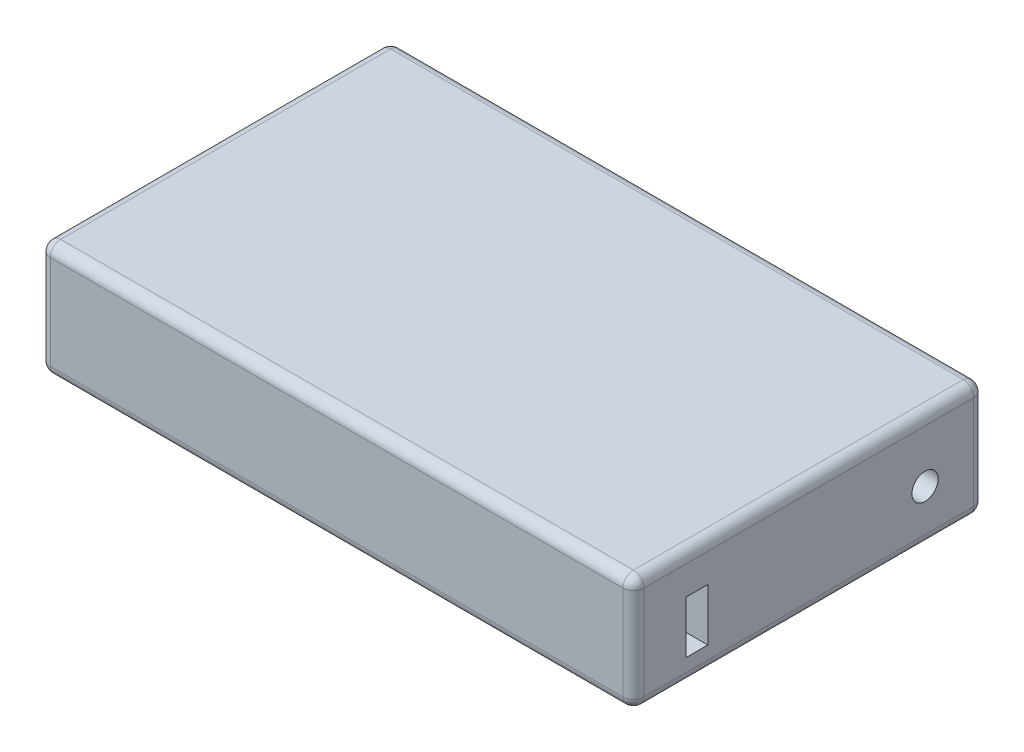
ISO-10303-21;
HEADER;
FILE_DESCRIPTION(('STEP AP214'),'2;1');
FILE_NAME('part.step','',(''),(''),'','','');
FILE_SCHEMA(('AUTOMOTIVE_DESIGN { 1 0 10303 214 1 1 1 1 }'));
ENDSEC;
DATA;
#1=APPLICATION_CONTEXT('core data for automotive mechanical design processes');
#2=APPLICATION_PROTOCOL_DEFINITION('international standard','automotive_design',2000,#1);
#3=PRODUCT_CONTEXT('',#1,'mechanical');
#4=PRODUCT('Part','Part','',(#3));
#5=PRODUCT_RELATED_PRODUCT_CATEGORY('part','',(#4));
#6=PRODUCT_DEFINITION_FORMATION('','',#4);
#7=PRODUCT_DEFINITION_CONTEXT('part definition',#1,'design');
#8=PRODUCT_DEFINITION('design','',#6,#7);
#9=PRODUCT_DEFINITION_SHAPE('','',#8);
#10=(LENGTH_UNIT() NAMED_UNIT(*) SI_UNIT(.MILLI.,.METRE.));
#11=(NAMED_UNIT(*) PLANE_ANGLE_UNIT() SI_UNIT($,.RADIAN.));
#12=(NAMED_UNIT(*) SI_UNIT($,.STERADIAN.) SOLID_ANGLE_UNIT());
#13=UNCERTAINTY_MEASURE_WITH_UNIT(LENGTH_MEASURE(1.E-05),#10,'distance_accuracy_value','');
#14=(GEOMETRIC_REPRESENTATION_CONTEXT(3) GLOBAL_UNCERTAINTY_ASSIGNED_CONTEXT((#13)) GLOBAL_UNIT_ASSIGNED_CONTEXT((#10,
#11,#12)) REPRESENTATION_CONTEXT('',''));
#15=CARTESIAN_POINT('',(0.,0.,0.));
#16=DIRECTION('',(0.,0.,1.));
#17=DIRECTION('',(1.,0.,0.));
#18=AXIS2_PLACEMENT_3D('',#15,#16,#17);
#19=CARTESIAN_POINT('',(72.009,27.94,-42.545));
#20=DIRECTION('',(-1.,0.,0.));
#21=DIRECTION('',(0.,0.,1.));
#22=AXIS2_PLACEMENT_3D('',#19,#20,#21);
#23=PLANE('',#22);
#24=DIRECTION('',(0.,0.,-1.));
#25=VECTOR('',#24,1.);
#26=CARTESIAN_POINT('',(72.009,5.715,29.845));
#27=LINE('',#26,#25);
#28=CARTESIAN_POINT('',(72.009,5.715,29.845));
#29=VERTEX_POINT('',#28);
#30=CARTESIAN_POINT('',(72.009,5.715,24.511));
#31=VERTEX_POINT('',#30);
#32=EDGE_CURVE('E186',#29,#31,#27,.T.);
#33=ORIENTED_EDGE('',*,*,#32,.F.);
#34=DIRECTION('',(0.,-1.,0.));
#35=VECTOR('',#34,1.);
#36=CARTESIAN_POINT('',(72.009,18.415,29.845));
#37=LINE('',#36,#35);
#38=CARTESIAN_POINT('',(72.009,18.415,29.845));
#39=VERTEX_POINT('',#38);
#40=EDGE_CURVE('E60',#39,#29,#37,.T.);
#41=ORIENTED_EDGE('',*,*,#40,.F.);
#42=DIRECTION('',(0.,0.,1.));
#43=VECTOR('',#42,1.);
#44=CARTESIAN_POINT('',(72.009,18.415,29.845));
#45=LINE('',#44,#43);
#46=CARTESIAN_POINT('',(72.009,18.415,24.511));
#47=VERTEX_POINT('',#46);
#48=EDGE_CURVE('E177',#47,#39,#45,.T.);
#49=ORIENTED_EDGE('',*,*,#48,.F.);
#50=DIRECTION('',(0.,1.,0.));
#51=VECTOR('',#50,1.);
#52=CARTESIAN_POINT('',(72.009,18.415,24.511));
#53=LINE('',#52,#51);
#54=EDGE_CURVE('E180',#31,#47,#53,.T.);
#55=ORIENTED_EDGE('',*,*,#54,.F.);
#56=EDGE_LOOP('',(#33,#41,#49,#55));
#57=FACE_BOUND('',#56,.T.);
#58=CARTESIAN_POINT('',(72.009,12.7,-28.194));
#59=DIRECTION('',(1.,0.,0.));
#60=DIRECTION('',(0.,0.,-1.));
#61=AXIS2_PLACEMENT_3D('',#58,#59,#60);
#62=CIRCLE('',#61,3.175);
#63=CARTESIAN_POINT('',(72.009,12.7,-31.369));
#64=VERTEX_POINT('',#63);
#65=EDGE_CURVE('E199',#64,#64,#62,.T.);
#66=ORIENTED_EDGE('',*,*,#65,.F.);
#67=EDGE_LOOP('',(#66));
#68=FACE_BOUND('',#67,.T.);
#69=DIRECTION('',(0.,0.,-1.));
#70=VECTOR('',#69,1.);
#71=CARTESIAN_POINT('',(72.009,2.54,-42.545));
#72=LINE('',#71,#70);
#73=CARTESIAN_POINT('',(72.009,2.54,40.005));
#74=VERTEX_POINT('',#73);
#75=CARTESIAN_POINT('',(72.009,2.54,-40.005));
#76=VERTEX_POINT('',#75);
#77=EDGE_CURVE('E233',#74,#76,#72,.T.);
#78=ORIENTED_EDGE('',*,*,#77,.T.);
#79=DIRECTION('',(0.,-1.,0.));
#80=VECTOR('',#79,1.);
#81=CARTESIAN_POINT('',(72.009,27.94,-40.005));
#82=LINE('',#81,#80);
#83=CARTESIAN_POINT('',(72.009,25.4,-40.005));
#84=VERTEX_POINT('',#83);
#85=EDGE_CURVE('E235',#76,#84,#82,.F.);
#86=ORIENTED_EDGE('',*,*,#85,.T.);
#87=DIRECTION('',(0.,0.,-1.));
#88=VECTOR('',#87,1.);
#89=CARTESIAN_POINT('',(72.009,25.4,42.545));
#90=LINE('',#89,#88);
#91=CARTESIAN_POINT('',(72.009,25.4,40.005));
#92=VERTEX_POINT('',#91);
#93=EDGE_CURVE('E229',#84,#92,#90,.F.);
#94=ORIENTED_EDGE('',*,*,#93,.T.);
#95=DIRECTION('',(0.,-1.,0.));
#96=VECTOR('',#95,1.);
#97=CARTESIAN_POINT('',(72.009,27.94,40.005));
#98=LINE('',#97,#96);
#99=EDGE_CURVE('E231',#92,#74,#98,.T.);
#100=ORIENTED_EDGE('',*,*,#99,.T.);
#101=EDGE_LOOP('',(#78,#86,#94,#100));
#102=FACE_BOUND('',#101,.T.);
#103=ADVANCED_FACE('F43',(#57,#68,#102),#23,.F.);
#104=CARTESIAN_POINT('',(-72.009,27.94,-42.545));
#105=DIRECTION('',(0.,0.,1.));
#106=DIRECTION('',(1.,0.,0.));
#107=AXIS2_PLACEMENT_3D('',#104,#105,#106);
#108=PLANE('',#107);
#109=DIRECTION('',(-1.,0.,0.));
#110=VECTOR('',#109,1.);
#111=CARTESIAN_POINT('',(-72.009,2.54,-42.545));
#112=LINE('',#111,#110);
#113=CARTESIAN_POINT('',(69.469,2.54,-42.545));
#114=VERTEX_POINT('',#113);
#115=CARTESIAN_POINT('',(-69.469,2.54,-42.545));
#116=VERTEX_POINT('',#115);
#117=EDGE_CURVE('E215',#114,#116,#112,.T.);
#118=ORIENTED_EDGE('',*,*,#117,.T.);
#119=DIRECTION('',(0.,-1.,0.));
#120=VECTOR('',#119,1.);
#121=CARTESIAN_POINT('',(-69.469,27.94,-42.545));
#122=LINE('',#121,#120);
#123=CARTESIAN_POINT('',(-69.469,25.4,-42.545));
#124=VERTEX_POINT('',#123);
#125=EDGE_CURVE('E217',#116,#124,#122,.F.);
#126=ORIENTED_EDGE('',*,*,#125,.T.);
#127=DIRECTION('',(-1.,0.,0.));
#128=VECTOR('',#127,1.);
#129=CARTESIAN_POINT('',(72.009,25.4,-42.545));
#130=LINE('',#129,#128);
#131=CARTESIAN_POINT('',(69.469,25.4,-42.545));
#132=VERTEX_POINT('',#131);
#133=EDGE_CURVE('E211',#124,#132,#130,.F.);
#134=ORIENTED_EDGE('',*,*,#133,.T.);
#135=DIRECTION('',(0.,-1.,0.));
#136=VECTOR('',#135,1.);
#137=CARTESIAN_POINT('',(69.469,27.94,-42.545));
#138=LINE('',#137,#136);
#139=EDGE_CURVE('E213',#132,#114,#138,.T.);
#140=ORIENTED_EDGE('',*,*,#139,.T.);
#141=EDGE_LOOP('',(#118,#126,#134,#140));
#142=FACE_BOUND('',#141,.T.);
#143=ADVANCED_FACE('F415',(#142),#108,.F.);
#144=CARTESIAN_POINT('',(-72.009,27.94,-42.545));
#145=DIRECTION('',(1.,0.,0.));
#146=DIRECTION('',(0.,0.,-1.));
#147=AXIS2_PLACEMENT_3D('',#144,#145,#146);
#148=PLANE('',#147);
#149=DIRECTION('',(0.,0.,1.));
#150=VECTOR('',#149,1.);
#151=CARTESIAN_POINT('',(-72.009,25.4,-42.545));
#152=LINE('',#151,#150);
#153=CARTESIAN_POINT('',(-72.009,25.4,40.005));
#154=VERTEX_POINT('',#153);
#155=CARTESIAN_POINT('',(-72.009,25.4,-40.005));
#156=VERTEX_POINT('',#155);
#157=EDGE_CURVE('E202',#154,#156,#152,.F.);
#158=ORIENTED_EDGE('',*,*,#157,.T.);
#159=DIRECTION('',(0.,-1.,0.));
#160=VECTOR('',#159,1.);
#161=CARTESIAN_POINT('',(-72.009,27.94,-40.005));
#162=LINE('',#161,#160);
#163=CARTESIAN_POINT('',(-72.009,2.54,-40.005));
#164=VERTEX_POINT('',#163);
#165=EDGE_CURVE('E208',#156,#164,#162,.T.);
#166=ORIENTED_EDGE('',*,*,#165,.T.);
#167=DIRECTION('',(0.,0.,1.));
#168=VECTOR('',#167,1.);
#169=CARTESIAN_POINT('',(-72.009,2.54,-42.545));
#170=LINE('',#169,#168);
#171=CARTESIAN_POINT('',(-72.009,2.54,40.005));
#172=VERTEX_POINT('',#171);
#173=EDGE_CURVE('E206',#164,#172,#170,.T.);
#174=ORIENTED_EDGE('',*,*,#173,.T.);
#175=DIRECTION('',(0.,-1.,0.));
#176=VECTOR('',#175,1.);
#177=CARTESIAN_POINT('',(-72.009,27.94,40.005));
#178=LINE('',#177,#176);
#179=EDGE_CURVE('E204',#172,#154,#178,.F.);
#180=ORIENTED_EDGE('',*,*,#179,.T.);
#181=EDGE_LOOP('',(#158,#166,#174,#180));
#182=FACE_BOUND('',#181,.T.);
#183=ADVANCED_FACE('F348',(#182),#148,.F.);
#184=CARTESIAN_POINT('',(-72.009,27.94,42.545));
#185=DIRECTION('',(0.,0.,-1.));
#186=DIRECTION('',(-1.,0.,0.));
#187=AXIS2_PLACEMENT_3D('',#184,#185,#186);
#188=PLANE('',#187);
#189=DIRECTION('',(0.,-1.,0.));
#190=VECTOR('',#189,1.);
#191=CARTESIAN_POINT('',(-69.469,27.94,42.545));
#192=LINE('',#191,#190);
#193=CARTESIAN_POINT('',(-69.469,25.4,42.545));
#194=VERTEX_POINT('',#193);
#195=CARTESIAN_POINT('',(-69.469,2.54,42.545));
#196=VERTEX_POINT('',#195);
#197=EDGE_CURVE('E242',#194,#196,#192,.T.);
#198=ORIENTED_EDGE('',*,*,#197,.T.);
#199=DIRECTION('',(1.,0.,0.));
#200=VECTOR('',#199,1.);
#201=CARTESIAN_POINT('',(-72.009,2.54,42.545));
#202=LINE('',#201,#200);
#203=CARTESIAN_POINT('',(69.469,2.54,42.545));
#204=VERTEX_POINT('',#203);
#205=EDGE_CURVE('E245',#196,#204,#202,.T.);
#206=ORIENTED_EDGE('',*,*,#205,.T.);
#207=DIRECTION('',(0.,-1.,0.));
#208=VECTOR('',#207,1.);
#209=CARTESIAN_POINT('',(69.469,27.94,42.545));
#210=LINE('',#209,#208);
#211=CARTESIAN_POINT('',(69.469,25.4,42.545));
#212=VERTEX_POINT('',#211);
#213=EDGE_CURVE('E240',#204,#212,#210,.F.);
#214=ORIENTED_EDGE('',*,*,#213,.T.);
#215=DIRECTION('',(1.,0.,0.));
#216=VECTOR('',#215,1.);
#217=CARTESIAN_POINT('',(-72.009,25.4,42.545));
#218=LINE('',#217,#216);
#219=EDGE_CURVE('E238',#212,#194,#218,.F.);
#220=ORIENTED_EDGE('',*,*,#219,.T.);
#221=EDGE_LOOP('',(#198,#206,#214,#220));
#222=FACE_BOUND('',#221,.T.);
#223=ADVANCED_FACE('F358',(#222),#188,.F.);
#224=CARTESIAN_POINT('',(0.,27.94,0.));
#225=DIRECTION('',(0.,1.,0.));
#226=DIRECTION('',(0.,0.,1.));
#227=AXIS2_PLACEMENT_3D('',#224,#225,#226);
#228=PLANE('',#227);
#229=DIRECTION('',(0.,0.,1.));
#230=VECTOR('',#229,1.);
#231=CARTESIAN_POINT('',(-69.469,27.94,42.545));
#232=LINE('',#231,#230);
#233=CARTESIAN_POINT('',(-69.469,27.94,-40.005));
#234=VERTEX_POINT('',#233);
#235=CARTESIAN_POINT('',(-69.469,27.94,40.005));
#236=VERTEX_POINT('',#235);
#237=EDGE_CURVE('E52',#234,#236,#232,.T.);
#238=ORIENTED_EDGE('',*,*,#237,.T.);
#239=DIRECTION('',(1.,0.,0.));
#240=VECTOR('',#239,1.);
#241=CARTESIAN_POINT('',(72.009,27.94,40.005));
#242=LINE('',#241,#240);
#243=CARTESIAN_POINT('',(69.469,27.94,40.005));
#244=VERTEX_POINT('',#243);
#245=EDGE_CURVE('E12',#236,#244,#242,.T.);
#246=ORIENTED_EDGE('',*,*,#245,.T.);
#247=DIRECTION('',(0.,0.,-1.));
#248=VECTOR('',#247,1.);
#249=CARTESIAN_POINT('',(69.469,27.94,-42.545));
#250=LINE('',#249,#248);
#251=CARTESIAN_POINT('',(69.469,27.94,-40.005));
#252=VERTEX_POINT('',#251);
#253=EDGE_CURVE('E247',#244,#252,#250,.T.);
#254=ORIENTED_EDGE('',*,*,#253,.T.);
#255=DIRECTION('',(-1.,0.,0.));
#256=VECTOR('',#255,1.);
#257=CARTESIAN_POINT('',(-72.009,27.94,-40.005));
#258=LINE('',#257,#256);
#259=EDGE_CURVE('E249',#252,#234,#258,.T.);
#260=ORIENTED_EDGE('',*,*,#259,.T.);
#261=EDGE_LOOP('',(#238,#246,#254,#260));
#262=FACE_BOUND('',#261,.T.);
#263=ADVANCED_FACE('F332',(#262),#228,.T.);
#264=CARTESIAN_POINT('',(0.,0.,0.));
#265=DIRECTION('',(0.,1.,0.));
#266=DIRECTION('',(0.,0.,1.));
#267=AXIS2_PLACEMENT_3D('',#264,#265,#266);
#268=PLANE('',#267);
#269=DIRECTION('',(0.,0.,1.));
#270=VECTOR('',#269,1.);
#271=CARTESIAN_POINT('',(-69.469,0.,0.));
#272=LINE('',#271,#270);
#273=CARTESIAN_POINT('',(-69.469,0.,40.005));
#274=VERTEX_POINT('',#273);
#275=CARTESIAN_POINT('',(-69.469,0.,-40.005));
#276=VERTEX_POINT('',#275);
#277=EDGE_CURVE('E224',#274,#276,#272,.F.);
#278=ORIENTED_EDGE('',*,*,#277,.T.);
#279=DIRECTION('',(-1.,0.,0.));
#280=VECTOR('',#279,1.);
#281=CARTESIAN_POINT('',(0.,0.,-40.005));
#282=LINE('',#281,#280);
#283=CARTESIAN_POINT('',(69.469,0.,-40.005));
#284=VERTEX_POINT('',#283);
#285=EDGE_CURVE('E226',#276,#284,#282,.F.);
#286=ORIENTED_EDGE('',*,*,#285,.T.);
#287=DIRECTION('',(0.,0.,-1.));
#288=VECTOR('',#287,1.);
#289=CARTESIAN_POINT('',(69.469,0.,0.));
#290=LINE('',#289,#288);
#291=CARTESIAN_POINT('',(69.469,0.,40.005));
#292=VERTEX_POINT('',#291);
#293=EDGE_CURVE('E222',#284,#292,#290,.F.);
#294=ORIENTED_EDGE('',*,*,#293,.T.);
#295=DIRECTION('',(1.,0.,0.));
#296=VECTOR('',#295,1.);
#297=CARTESIAN_POINT('',(0.,0.,40.005));
#298=LINE('',#297,#296);
#299=EDGE_CURVE('E220',#292,#274,#298,.F.);
#300=ORIENTED_EDGE('',*,*,#299,.T.);
#301=EDGE_LOOP('',(#278,#286,#294,#300));
#302=FACE_BOUND('',#301,.T.);
#303=ADVANCED_FACE('F399',(#302),#268,.F.);
#304=CARTESIAN_POINT('',(69.469,27.94,40.005));
#305=DIRECTION('',(0.,-1.,0.));
#306=DIRECTION('',(0.,0.,-1.));
#307=AXIS2_PLACEMENT_3D('',#304,#305,#306);
#308=CYLINDRICAL_SURFACE('',#307,2.54);
#309=CARTESIAN_POINT('',(69.469,25.4,40.005));
#310=DIRECTION('',(0.,1.,0.));
#311=DIRECTION('',(0.,0.,1.));
#312=AXIS2_PLACEMENT_3D('',#309,#310,#311);
#313=CIRCLE('',#312,2.54);
#314=EDGE_CURVE('E47',#212,#92,#313,.T.);
#315=ORIENTED_EDGE('',*,*,#314,.F.);
#316=ORIENTED_EDGE('',*,*,#213,.F.);
#317=CARTESIAN_POINT('',(69.469,2.54,40.005));
#318=DIRECTION('',(0.,-1.,0.));
#319=DIRECTION('',(0.,0.,-1.));
#320=AXIS2_PLACEMENT_3D('',#317,#318,#319);
#321=CIRCLE('',#320,2.54);
#322=EDGE_CURVE('E311',#74,#204,#321,.T.);
#323=ORIENTED_EDGE('',*,*,#322,.F.);
#324=ORIENTED_EDGE('',*,*,#99,.F.);
#325=EDGE_LOOP('',(#315,#316,#323,#324));
#326=FACE_BOUND('',#325,.T.);
#327=ADVANCED_FACE('F45',(#326),#308,.T.);
#328=CARTESIAN_POINT('',(69.469,25.4,40.005));
#329=DIRECTION('',(1.,0.,0.));
#330=DIRECTION('',(0.,0.,-1.));
#331=AXIS2_PLACEMENT_3D('',#328,#329,#330);
#332=SPHERICAL_SURFACE('',#331,2.54);
#333=CARTESIAN_POINT('',(69.469,25.4,40.005));
#334=DIRECTION('',(1.,0.,0.));
#335=DIRECTION('',(0.,0.,-1.));
#336=AXIS2_PLACEMENT_3D('',#333,#334,#335);
#337=CIRCLE('',#336,2.54);
#338=EDGE_CURVE('E306',#212,#244,#337,.F.);
#339=ORIENTED_EDGE('',*,*,#338,.F.);
#340=ORIENTED_EDGE('',*,*,#314,.T.);
#341=CARTESIAN_POINT('',(69.469,25.4,40.005));
#342=DIRECTION('',(0.,0.,1.));
#343=DIRECTION('',(1.,0.,0.));
#344=AXIS2_PLACEMENT_3D('',#341,#342,#343);
#345=CIRCLE('',#344,2.54);
#346=EDGE_CURVE('E309',#244,#92,#345,.F.);
#347=ORIENTED_EDGE('',*,*,#346,.F.);
#348=EDGE_LOOP('',(#339,#340,#347));
#349=FACE_BOUND('',#348,.T.);
#350=ADVANCED_FACE('F322',(#349),#332,.T.);
#351=CARTESIAN_POINT('',(69.469,2.54,40.005));
#352=DIRECTION('',(0.,0.,1.));
#353=DIRECTION('',(0.,-1.,0.));
#354=AXIS2_PLACEMENT_3D('',#351,#352,#353);
#355=SPHERICAL_SURFACE('',#354,2.54);
#356=CARTESIAN_POINT('',(69.469,2.54,40.005));
#357=DIRECTION('',(0.,0.,1.));
#358=DIRECTION('',(1.,0.,0.));
#359=AXIS2_PLACEMENT_3D('',#356,#357,#358);
#360=CIRCLE('',#359,2.54);
#361=EDGE_CURVE('E300',#74,#292,#360,.F.);
#362=ORIENTED_EDGE('',*,*,#361,.F.);
#363=ORIENTED_EDGE('',*,*,#322,.T.);
#364=CARTESIAN_POINT('',(69.469,2.54,40.005));
#365=DIRECTION('',(1.,0.,0.));
#366=DIRECTION('',(0.,0.,-1.));
#367=AXIS2_PLACEMENT_3D('',#364,#365,#366);
#368=CIRCLE('',#367,2.54);
#369=EDGE_CURVE('E303',#292,#204,#368,.F.);
#370=ORIENTED_EDGE('',*,*,#369,.F.);
#371=EDGE_LOOP('',(#362,#363,#370));
#372=FACE_BOUND('',#371,.T.);
#373=ADVANCED_FACE('F360',(#372),#355,.T.);
#374=CARTESIAN_POINT('',(69.469,25.4,0.));
#375=DIRECTION('',(0.,0.,1.));
#376=DIRECTION('',(1.,0.,0.));
#377=AXIS2_PLACEMENT_3D('',#374,#375,#376);
#378=CYLINDRICAL_SURFACE('',#377,2.54);
#379=ORIENTED_EDGE('',*,*,#346,.T.);
#380=ORIENTED_EDGE('',*,*,#93,.F.);
#381=CARTESIAN_POINT('',(69.469,25.4,-40.005));
#382=DIRECTION('',(0.,0.,-1.));
#383=DIRECTION('',(-1.,0.,0.));
#384=AXIS2_PLACEMENT_3D('',#381,#382,#383);
#385=CIRCLE('',#384,2.54);
#386=EDGE_CURVE('E295',#252,#84,#385,.T.);
#387=ORIENTED_EDGE('',*,*,#386,.F.);
#388=ORIENTED_EDGE('',*,*,#253,.F.);
#389=EDGE_LOOP('',(#379,#380,#387,#388));
#390=FACE_BOUND('',#389,.T.);
#391=ADVANCED_FACE('F329',(#390),#378,.T.);
#392=CARTESIAN_POINT('',(0.,25.4,40.005));
#393=DIRECTION('',(-1.,0.,0.));
#394=DIRECTION('',(0.,0.,1.));
#395=AXIS2_PLACEMENT_3D('',#392,#393,#394);
#396=CYLINDRICAL_SURFACE('',#395,2.54);
#397=ORIENTED_EDGE('',*,*,#338,.T.);
#398=ORIENTED_EDGE('',*,*,#245,.F.);
#399=CARTESIAN_POINT('',(-69.469,25.4,40.005));
#400=DIRECTION('',(-1.,0.,0.));
#401=DIRECTION('',(0.,0.,1.));
#402=AXIS2_PLACEMENT_3D('',#399,#400,#401);
#403=CIRCLE('',#402,2.54);
#404=EDGE_CURVE('E292',#194,#236,#403,.T.);
#405=ORIENTED_EDGE('',*,*,#404,.F.);
#406=ORIENTED_EDGE('',*,*,#219,.F.);
#407=EDGE_LOOP('',(#397,#398,#405,#406));
#408=FACE_BOUND('',#407,.T.);
#409=ADVANCED_FACE('F336',(#408),#396,.T.);
#410=CARTESIAN_POINT('',(-69.469,27.94,40.005));
#411=DIRECTION('',(0.,-1.,0.));
#412=DIRECTION('',(0.,0.,-1.));
#413=AXIS2_PLACEMENT_3D('',#410,#411,#412);
#414=CYLINDRICAL_SURFACE('',#413,2.54);
#415=CARTESIAN_POINT('',(-69.469,2.54,40.005));
#416=DIRECTION('',(0.,-1.,0.));
#417=DIRECTION('',(0.,0.,-1.));
#418=AXIS2_PLACEMENT_3D('',#415,#416,#417);
#419=CIRCLE('',#418,2.54);
#420=EDGE_CURVE('E286',#196,#172,#419,.T.);
#421=ORIENTED_EDGE('',*,*,#420,.F.);
#422=ORIENTED_EDGE('',*,*,#197,.F.);
#423=CARTESIAN_POINT('',(-69.469,25.4,40.005));
#424=DIRECTION('',(0.,1.,0.));
#425=DIRECTION('',(0.,0.,1.));
#426=AXIS2_PLACEMENT_3D('',#423,#424,#425);
#427=CIRCLE('',#426,2.54);
#428=EDGE_CURVE('E289',#154,#194,#427,.T.);
#429=ORIENTED_EDGE('',*,*,#428,.F.);
#430=ORIENTED_EDGE('',*,*,#179,.F.);
#431=EDGE_LOOP('',(#421,#422,#429,#430));
#432=FACE_BOUND('',#431,.T.);
#433=ADVANCED_FACE('F355',(#432),#414,.T.);
#434=CARTESIAN_POINT('',(-72.009,2.54,40.005));
#435=DIRECTION('',(1.,0.,0.));
#436=DIRECTION('',(0.,0.,-1.));
#437=AXIS2_PLACEMENT_3D('',#434,#435,#436);
#438=CYLINDRICAL_SURFACE('',#437,2.54);
#439=ORIENTED_EDGE('',*,*,#369,.T.);
#440=ORIENTED_EDGE('',*,*,#205,.F.);
#441=CARTESIAN_POINT('',(-69.469,2.54,40.005));
#442=DIRECTION('',(-1.,0.,0.));
#443=DIRECTION('',(0.,0.,1.));
#444=AXIS2_PLACEMENT_3D('',#441,#442,#443);
#445=CIRCLE('',#444,2.54);
#446=EDGE_CURVE('E284',#274,#196,#445,.T.);
#447=ORIENTED_EDGE('',*,*,#446,.F.);
#448=ORIENTED_EDGE('',*,*,#299,.F.);
#449=EDGE_LOOP('',(#439,#440,#447,#448));
#450=FACE_BOUND('',#449,.T.);
#451=ADVANCED_FACE('F397',(#450),#438,.T.);
#452=CARTESIAN_POINT('',(69.469,2.54,-42.545));
#453=DIRECTION('',(0.,0.,-1.));
#454=DIRECTION('',(-1.,0.,0.));
#455=AXIS2_PLACEMENT_3D('',#452,#453,#454);
#456=CYLINDRICAL_SURFACE('',#455,2.54);
#457=ORIENTED_EDGE('',*,*,#361,.T.);
#458=ORIENTED_EDGE('',*,*,#293,.F.);
#459=CARTESIAN_POINT('',(69.469,2.54,-40.005));
#460=DIRECTION('',(0.,0.,-1.));
#461=DIRECTION('',(-1.,0.,0.));
#462=AXIS2_PLACEMENT_3D('',#459,#460,#461);
#463=CIRCLE('',#462,2.54);
#464=EDGE_CURVE('E281',#76,#284,#463,.T.);
#465=ORIENTED_EDGE('',*,*,#464,.F.);
#466=ORIENTED_EDGE('',*,*,#77,.F.);
#467=EDGE_LOOP('',(#457,#458,#465,#466));
#468=FACE_BOUND('',#467,.T.);
#469=ADVANCED_FACE('F365',(#468),#456,.T.);
#470=CARTESIAN_POINT('',(69.469,27.94,-40.005));
#471=DIRECTION('',(0.,-1.,0.));
#472=DIRECTION('',(0.,0.,-1.));
#473=AXIS2_PLACEMENT_3D('',#470,#471,#472);
#474=CYLINDRICAL_SURFACE('',#473,2.54);
#475=CARTESIAN_POINT('',(69.469,25.4,-40.005));
#476=DIRECTION('',(0.,1.,0.));
#477=DIRECTION('',(0.,0.,1.));
#478=AXIS2_PLACEMENT_3D('',#475,#476,#477);
#479=CIRCLE('',#478,2.54);
#480=EDGE_CURVE('E297',#84,#132,#479,.T.);
#481=ORIENTED_EDGE('',*,*,#480,.F.);
#482=ORIENTED_EDGE('',*,*,#85,.F.);
#483=CARTESIAN_POINT('',(69.469,2.54,-40.005));
#484=DIRECTION('',(0.,-1.,0.));
#485=DIRECTION('',(0.,0.,-1.));
#486=AXIS2_PLACEMENT_3D('',#483,#484,#485);
#487=CIRCLE('',#486,2.54);
#488=EDGE_CURVE('E278',#114,#76,#487,.T.);
#489=ORIENTED_EDGE('',*,*,#488,.F.);
#490=ORIENTED_EDGE('',*,*,#139,.F.);
#491=EDGE_LOOP('',(#481,#482,#489,#490));
#492=FACE_BOUND('',#491,.T.);
#493=ADVANCED_FACE('F371',(#492),#474,.T.);
#494=CARTESIAN_POINT('',(69.469,25.4,-40.005));
#495=DIRECTION('',(1.,0.,0.));
#496=DIRECTION('',(0.,0.,-1.));
#497=AXIS2_PLACEMENT_3D('',#494,#495,#496);
#498=SPHERICAL_SURFACE('',#497,2.54);
#499=ORIENTED_EDGE('',*,*,#386,.T.);
#500=ORIENTED_EDGE('',*,*,#480,.T.);
#501=CARTESIAN_POINT('',(69.469,25.4,-40.005));
#502=DIRECTION('',(1.,0.,0.));
#503=DIRECTION('',(0.,1.,0.));
#504=AXIS2_PLACEMENT_3D('',#501,#502,#503);
#505=CIRCLE('',#504,2.54);
#506=EDGE_CURVE('E275',#252,#132,#505,.F.);
#507=ORIENTED_EDGE('',*,*,#506,.F.);
#508=EDGE_LOOP('',(#499,#500,#507));
#509=FACE_BOUND('',#508,.T.);
#510=ADVANCED_FACE('F375',(#509),#498,.T.);
#511=CARTESIAN_POINT('',(-69.469,25.4,40.005));
#512=DIRECTION('',(0.,0.,1.));
#513=DIRECTION('',(1.,0.,0.));
#514=AXIS2_PLACEMENT_3D('',#511,#512,#513);
#515=SPHERICAL_SURFACE('',#514,2.54);
#516=ORIENTED_EDGE('',*,*,#428,.T.);
#517=ORIENTED_EDGE('',*,*,#404,.T.);
#518=CARTESIAN_POINT('',(-69.469,25.4,40.005));
#519=DIRECTION('',(0.,0.,1.));
#520=DIRECTION('',(1.,0.,0.));
#521=AXIS2_PLACEMENT_3D('',#518,#519,#520);
#522=CIRCLE('',#521,2.54);
#523=EDGE_CURVE('E272',#154,#236,#522,.F.);
#524=ORIENTED_EDGE('',*,*,#523,.F.);
#525=EDGE_LOOP('',(#516,#517,#524));
#526=FACE_BOUND('',#525,.T.);
#527=ADVANCED_FACE('F339',(#526),#515,.T.);
#528=CARTESIAN_POINT('',(-69.469,2.54,40.005));
#529=DIRECTION('',(0.,0.,1.));
#530=DIRECTION('',(0.,-1.,0.));
#531=AXIS2_PLACEMENT_3D('',#528,#529,#530);
#532=SPHERICAL_SURFACE('',#531,2.54);
#533=ORIENTED_EDGE('',*,*,#446,.T.);
#534=ORIENTED_EDGE('',*,*,#420,.T.);
#535=CARTESIAN_POINT('',(-69.469,2.54,40.005));
#536=DIRECTION('',(0.,0.,1.));
#537=DIRECTION('',(1.,0.,0.));
#538=AXIS2_PLACEMENT_3D('',#535,#536,#537);
#539=CIRCLE('',#538,2.54);
#540=EDGE_CURVE('E269',#274,#172,#539,.F.);
#541=ORIENTED_EDGE('',*,*,#540,.F.);
#542=EDGE_LOOP('',(#533,#534,#541));
#543=FACE_BOUND('',#542,.T.);
#544=ADVANCED_FACE('F394',(#543),#532,.T.);
#545=CARTESIAN_POINT('',(69.469,2.54,-40.005));
#546=DIRECTION('',(1.,0.,0.));
#547=DIRECTION('',(0.,1.,0.));
#548=AXIS2_PLACEMENT_3D('',#545,#546,#547);
#549=SPHERICAL_SURFACE('',#548,2.54);
#550=ORIENTED_EDGE('',*,*,#488,.T.);
#551=ORIENTED_EDGE('',*,*,#464,.T.);
#552=CARTESIAN_POINT('',(69.469,2.54,-40.005));
#553=DIRECTION('',(1.,0.,0.));
#554=DIRECTION('',(0.,0.,-1.));
#555=AXIS2_PLACEMENT_3D('',#552,#553,#554);
#556=CIRCLE('',#555,2.54);
#557=EDGE_CURVE('E267',#114,#284,#556,.F.);
#558=ORIENTED_EDGE('',*,*,#557,.F.);
#559=EDGE_LOOP('',(#550,#551,#558));
#560=FACE_BOUND('',#559,.T.);
#561=ADVANCED_FACE('F405',(#560),#549,.T.);
#562=CARTESIAN_POINT('',(0.,25.4,-40.005));
#563=DIRECTION('',(1.,0.,0.));
#564=DIRECTION('',(0.,0.,-1.));
#565=AXIS2_PLACEMENT_3D('',#562,#563,#564);
#566=CYLINDRICAL_SURFACE('',#565,2.54);
#567=ORIENTED_EDGE('',*,*,#506,.T.);
#568=ORIENTED_EDGE('',*,*,#133,.F.);
#569=CARTESIAN_POINT('',(-69.469,25.4,-40.005));
#570=DIRECTION('',(-1.,0.,0.));
#571=DIRECTION('',(0.,0.,1.));
#572=AXIS2_PLACEMENT_3D('',#569,#570,#571);
#573=CIRCLE('',#572,2.54);
#574=EDGE_CURVE('E264',#234,#124,#573,.T.);
#575=ORIENTED_EDGE('',*,*,#574,.F.);
#576=ORIENTED_EDGE('',*,*,#259,.F.);
#577=EDGE_LOOP('',(#567,#568,#575,#576));
#578=FACE_BOUND('',#577,.T.);
#579=ADVANCED_FACE('F378',(#578),#566,.T.);
#580=CARTESIAN_POINT('',(-69.469,25.4,0.));
#581=DIRECTION('',(0.,0.,-1.));
#582=DIRECTION('',(-1.,0.,0.));
#583=AXIS2_PLACEMENT_3D('',#580,#581,#582);
#584=CYLINDRICAL_SURFACE('',#583,2.54);
#585=ORIENTED_EDGE('',*,*,#523,.T.);
#586=ORIENTED_EDGE('',*,*,#237,.F.);
#587=CARTESIAN_POINT('',(-69.469,25.4,-40.005));
#588=DIRECTION('',(0.,0.,-1.));
#589=DIRECTION('',(-1.,0.,0.));
#590=AXIS2_PLACEMENT_3D('',#587,#588,#589);
#591=CIRCLE('',#590,2.54);
#592=EDGE_CURVE('E261',#156,#234,#591,.T.);
#593=ORIENTED_EDGE('',*,*,#592,.F.);
#594=ORIENTED_EDGE('',*,*,#157,.F.);
#595=EDGE_LOOP('',(#585,#586,#593,#594));
#596=FACE_BOUND('',#595,.T.);
#597=ADVANCED_FACE('F343',(#596),#584,.T.);
#598=CARTESIAN_POINT('',(-69.469,2.54,-42.545));
#599=DIRECTION('',(0.,0.,1.));
#600=DIRECTION('',(1.,0.,0.));
#601=AXIS2_PLACEMENT_3D('',#598,#599,#600);
#602=CYLINDRICAL_SURFACE('',#601,2.54);
#603=ORIENTED_EDGE('',*,*,#540,.T.);
#604=ORIENTED_EDGE('',*,*,#173,.F.);
#605=CARTESIAN_POINT('',(-69.469,2.54,-40.005));
#606=DIRECTION('',(0.,0.,-1.));
#607=DIRECTION('',(-1.,0.,0.));
#608=AXIS2_PLACEMENT_3D('',#605,#606,#607);
#609=CIRCLE('',#608,2.54);
#610=EDGE_CURVE('E258',#276,#164,#609,.T.);
#611=ORIENTED_EDGE('',*,*,#610,.F.);
#612=ORIENTED_EDGE('',*,*,#277,.F.);
#613=EDGE_LOOP('',(#603,#604,#611,#612));
#614=FACE_BOUND('',#613,.T.);
#615=ADVANCED_FACE('F391',(#614),#602,.T.);
#616=CARTESIAN_POINT('',(-72.009,2.54,-40.005));
#617=DIRECTION('',(-1.,0.,0.));
#618=DIRECTION('',(0.,0.,1.));
#619=AXIS2_PLACEMENT_3D('',#616,#617,#618);
#620=CYLINDRICAL_SURFACE('',#619,2.54);
#621=ORIENTED_EDGE('',*,*,#557,.T.);
#622=ORIENTED_EDGE('',*,*,#285,.F.);
#623=CARTESIAN_POINT('',(-69.469,2.54,-40.005));
#624=DIRECTION('',(-1.,0.,0.));
#625=DIRECTION('',(0.,0.,1.));
#626=AXIS2_PLACEMENT_3D('',#623,#624,#625);
#627=CIRCLE('',#626,2.54);
#628=EDGE_CURVE('E255',#116,#276,#627,.T.);
#629=ORIENTED_EDGE('',*,*,#628,.F.);
#630=ORIENTED_EDGE('',*,*,#117,.F.);
#631=EDGE_LOOP('',(#621,#622,#629,#630));
#632=FACE_BOUND('',#631,.T.);
#633=ADVANCED_FACE('F402',(#632),#620,.T.);
#634=CARTESIAN_POINT('',(-69.469,25.4,-40.005));
#635=DIRECTION('',(0.,1.,0.));
#636=DIRECTION('',(0.,0.,1.));
#637=AXIS2_PLACEMENT_3D('',#634,#635,#636);
#638=SPHERICAL_SURFACE('',#637,2.54);
#639=ORIENTED_EDGE('',*,*,#592,.T.);
#640=ORIENTED_EDGE('',*,*,#574,.T.);
#641=CARTESIAN_POINT('',(-69.469,25.4,-40.005));
#642=DIRECTION('',(0.,1.,0.));
#643=DIRECTION('',(0.,0.,1.));
#644=AXIS2_PLACEMENT_3D('',#641,#642,#643);
#645=CIRCLE('',#644,2.54);
#646=EDGE_CURVE('E253',#156,#124,#645,.F.);
#647=ORIENTED_EDGE('',*,*,#646,.F.);
#648=EDGE_LOOP('',(#639,#640,#647));
#649=FACE_BOUND('',#648,.T.);
#650=ADVANCED_FACE('F380',(#649),#638,.T.);
#651=CARTESIAN_POINT('',(-69.469,2.54,-40.005));
#652=DIRECTION('',(0.,-1.,0.));
#653=DIRECTION('',(0.,0.,-1.));
#654=AXIS2_PLACEMENT_3D('',#651,#652,#653);
#655=SPHERICAL_SURFACE('',#654,2.54);
#656=ORIENTED_EDGE('',*,*,#628,.T.);
#657=ORIENTED_EDGE('',*,*,#610,.T.);
#658=CARTESIAN_POINT('',(-69.469,2.54,-40.005));
#659=DIRECTION('',(0.,-1.,0.));
#660=DIRECTION('',(0.,0.,-1.));
#661=AXIS2_PLACEMENT_3D('',#658,#659,#660);
#662=CIRCLE('',#661,2.54);
#663=EDGE_CURVE('E193',#116,#164,#662,.F.);
#664=ORIENTED_EDGE('',*,*,#663,.F.);
#665=EDGE_LOOP('',(#656,#657,#664));
#666=FACE_BOUND('',#665,.T.);
#667=ADVANCED_FACE('F387',(#666),#655,.T.);
#668=CARTESIAN_POINT('',(-69.469,27.94,-40.005));
#669=DIRECTION('',(0.,-1.,0.));
#670=DIRECTION('',(0.,0.,-1.));
#671=AXIS2_PLACEMENT_3D('',#668,#669,#670);
#672=CYLINDRICAL_SURFACE('',#671,2.54);
#673=ORIENTED_EDGE('',*,*,#646,.T.);
#674=ORIENTED_EDGE('',*,*,#125,.F.);
#675=ORIENTED_EDGE('',*,*,#663,.T.);
#676=ORIENTED_EDGE('',*,*,#165,.F.);
#677=EDGE_LOOP('',(#673,#674,#675,#676));
#678=FACE_BOUND('',#677,.T.);
#679=ADVANCED_FACE('F383',(#678),#672,.T.);
#680=CARTESIAN_POINT('',(59.309,12.7,-28.194));
#681=DIRECTION('',(1.,0.,0.));
#682=DIRECTION('',(0.,0.,-1.));
#683=AXIS2_PLACEMENT_3D('',#680,#681,#682);
#684=CYLINDRICAL_SURFACE('',#683,3.175);
#685=CARTESIAN_POINT('',(59.309,12.7,-28.194));
#686=DIRECTION('',(1.,0.,0.));
#687=DIRECTION('',(0.,0.,-1.));
#688=AXIS2_PLACEMENT_3D('',#685,#686,#687);
#689=CIRCLE('',#688,3.175);
#690=CARTESIAN_POINT('',(59.309,12.7,-31.369));
#691=VERTEX_POINT('',#690);
#692=EDGE_CURVE('E187',#691,#691,#689,.T.);
#693=ORIENTED_EDGE('',*,*,#692,.F.);
#694=EDGE_LOOP('',(#693));
#695=FACE_BOUND('',#694,.T.);
#696=ORIENTED_EDGE('',*,*,#65,.T.);
#697=EDGE_LOOP('',(#696));
#698=FACE_BOUND('',#697,.T.);
#699=ADVANCED_FACE('F428',(#695,#698),#684,.F.);
#700=CARTESIAN_POINT('',(59.309,12.7,-28.194));
#701=DIRECTION('',(1.,0.,0.));
#702=DIRECTION('',(0.,0.,-1.));
#703=AXIS2_PLACEMENT_3D('',#700,#701,#702);
#704=PLANE('',#703);
#705=ORIENTED_EDGE('',*,*,#692,.T.);
#706=EDGE_LOOP('',(#705));
#707=FACE_BOUND('',#706,.T.);
#708=ADVANCED_FACE('F468',(#707),#704,.T.);
#709=CARTESIAN_POINT('',(59.309,18.415,29.845));
#710=DIRECTION('',(0.,0.,1.));
#711=DIRECTION('',(1.,0.,0.));
#712=AXIS2_PLACEMENT_3D('',#709,#710,#711);
#713=PLANE('',#712);
#714=ORIENTED_EDGE('',*,*,#40,.T.);
#715=DIRECTION('',(1.,0.,0.));
#716=VECTOR('',#715,1.);
#717=CARTESIAN_POINT('',(59.309,5.715,29.845));
#718=LINE('',#717,#716);
#719=CARTESIAN_POINT('',(59.309,5.715,29.845));
#720=VERTEX_POINT('',#719);
#721=EDGE_CURVE('E155',#720,#29,#718,.T.);
#722=ORIENTED_EDGE('',*,*,#721,.F.);
#723=DIRECTION('',(0.,-1.,0.));
#724=VECTOR('',#723,1.);
#725=CARTESIAN_POINT('',(59.309,18.415,29.845));
#726=LINE('',#725,#724);
#727=CARTESIAN_POINT('',(59.309,18.415,29.845));
#728=VERTEX_POINT('',#727);
#729=EDGE_CURVE('E159',#728,#720,#726,.T.);
#730=ORIENTED_EDGE('',*,*,#729,.F.);
#731=DIRECTION('',(1.,0.,0.));
#732=VECTOR('',#731,1.);
#733=CARTESIAN_POINT('',(59.309,18.415,29.845));
#734=LINE('',#733,#732);
#735=EDGE_CURVE('E191',#728,#39,#734,.T.);
#736=ORIENTED_EDGE('',*,*,#735,.T.);
#737=EDGE_LOOP('',(#714,#722,#730,#736));
#738=FACE_BOUND('',#737,.T.);
#739=ADVANCED_FACE('F157',(#738),#713,.F.);
#740=CARTESIAN_POINT('',(59.309,18.415,29.845));
#741=DIRECTION('',(0.,1.,0.));
#742=DIRECTION('',(0.,0.,1.));
#743=AXIS2_PLACEMENT_3D('',#740,#741,#742);
#744=PLANE('',#743);
#745=ORIENTED_EDGE('',*,*,#48,.T.);
#746=ORIENTED_EDGE('',*,*,#735,.F.);
#747=DIRECTION('',(0.,0.,1.));
#748=VECTOR('',#747,1.);
#749=CARTESIAN_POINT('',(59.309,18.415,29.845));
#750=LINE('',#749,#748);
#751=CARTESIAN_POINT('',(59.309,18.415,24.511));
#752=VERTEX_POINT('',#751);
#753=EDGE_CURVE('E165',#752,#728,#750,.T.);
#754=ORIENTED_EDGE('',*,*,#753,.F.);
#755=DIRECTION('',(1.,0.,0.));
#756=VECTOR('',#755,1.);
#757=CARTESIAN_POINT('',(59.309,18.415,24.511));
#758=LINE('',#757,#756);
#759=EDGE_CURVE('E194',#752,#47,#758,.T.);
#760=ORIENTED_EDGE('',*,*,#759,.T.);
#761=EDGE_LOOP('',(#745,#746,#754,#760));
#762=FACE_BOUND('',#761,.T.);
#763=ADVANCED_FACE('F485',(#762),#744,.F.);
#764=CARTESIAN_POINT('',(59.309,18.415,24.511));
#765=DIRECTION('',(0.,0.,-1.));
#766=DIRECTION('',(-1.,0.,0.));
#767=AXIS2_PLACEMENT_3D('',#764,#765,#766);
#768=PLANE('',#767);
#769=ORIENTED_EDGE('',*,*,#54,.T.);
#770=ORIENTED_EDGE('',*,*,#759,.F.);
#771=DIRECTION('',(0.,1.,0.));
#772=VECTOR('',#771,1.);
#773=CARTESIAN_POINT('',(59.309,18.415,24.511));
#774=LINE('',#773,#772);
#775=CARTESIAN_POINT('',(59.309,5.715,24.511));
#776=VERTEX_POINT('',#775);
#777=EDGE_CURVE('E173',#776,#752,#774,.T.);
#778=ORIENTED_EDGE('',*,*,#777,.F.);
#779=DIRECTION('',(1.,0.,0.));
#780=VECTOR('',#779,1.);
#781=CARTESIAN_POINT('',(59.309,5.715,24.511));
#782=LINE('',#781,#780);
#783=EDGE_CURVE('E164',#776,#31,#782,.T.);
#784=ORIENTED_EDGE('',*,*,#783,.T.);
#785=EDGE_LOOP('',(#769,#770,#778,#784));
#786=FACE_BOUND('',#785,.T.);
#787=ADVANCED_FACE('F493',(#786),#768,.F.);
#788=CARTESIAN_POINT('',(59.309,5.715,29.845));
#789=DIRECTION('',(0.,-1.,0.));
#790=DIRECTION('',(0.,0.,-1.));
#791=AXIS2_PLACEMENT_3D('',#788,#789,#790);
#792=PLANE('',#791);
#793=ORIENTED_EDGE('',*,*,#32,.T.);
#794=ORIENTED_EDGE('',*,*,#783,.F.);
#795=DIRECTION('',(0.,0.,-1.));
#796=VECTOR('',#795,1.);
#797=CARTESIAN_POINT('',(59.309,5.715,29.845));
#798=LINE('',#797,#796);
#799=EDGE_CURVE('E168',#720,#776,#798,.T.);
#800=ORIENTED_EDGE('',*,*,#799,.F.);
#801=ORIENTED_EDGE('',*,*,#721,.T.);
#802=EDGE_LOOP('',(#793,#794,#800,#801));
#803=FACE_BOUND('',#802,.T.);
#804=ADVANCED_FACE('F169',(#803),#792,.F.);
#805=CARTESIAN_POINT('',(59.309,0.,0.));
#806=DIRECTION('',(1.,0.,0.));
#807=DIRECTION('',(0.,0.,-1.));
#808=AXIS2_PLACEMENT_3D('',#805,#806,#807);
#809=PLANE('',#808);
#810=ORIENTED_EDGE('',*,*,#729,.T.);
#811=ORIENTED_EDGE('',*,*,#799,.T.);
#812=ORIENTED_EDGE('',*,*,#777,.T.);
#813=ORIENTED_EDGE('',*,*,#753,.T.);
#814=EDGE_LOOP('',(#810,#811,#812,#813));
#815=FACE_BOUND('',#814,.T.);
#816=ADVANCED_FACE('F175',(#815),#809,.T.);
#817=CLOSED_SHELL('',(#103,#143,#183,#223,#263,#303,#327,#350,#373,#391,#409,#433,#451,#469,
#493,#510,#527,#544,#561,#579,#597,#615,#633,#650,#667,#679,#699,#708,#739,#763,#787,#804,#816));
#818=MANIFOLD_SOLID_BREP('B2',#817);
#819=ADVANCED_BREP_SHAPE_REPRESENTATION('',(#18,#818),#14);
#820=SHAPE_DEFINITION_REPRESENTATION(#9,#819);
ENDSEC;
END-ISO-10303-21;
